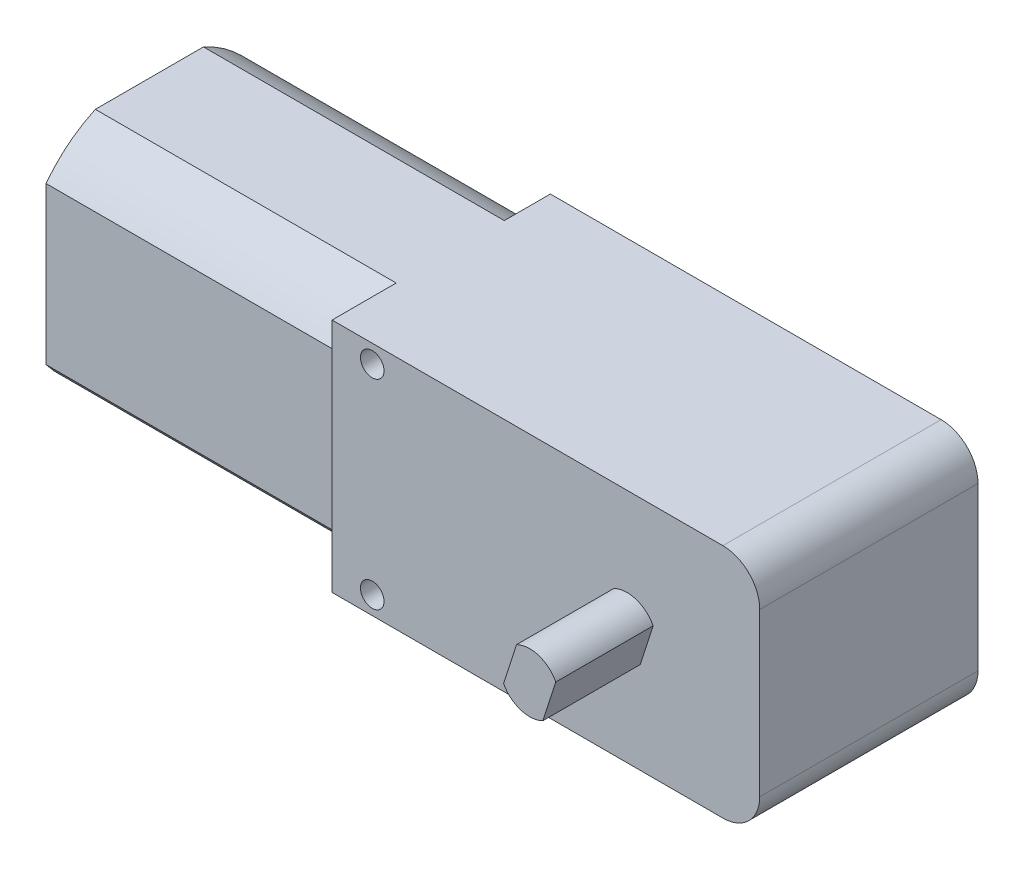
ISO-10303-21;
HEADER;
FILE_DESCRIPTION(('STEP AP214'),'2;1');
FILE_NAME('part.step','',(''),(''),'','','');
FILE_SCHEMA(('AUTOMOTIVE_DESIGN { 1 0 10303 214 1 1 1 1 }'));
ENDSEC;
DATA;
#1=APPLICATION_CONTEXT('core data for automotive mechanical design processes');
#2=APPLICATION_PROTOCOL_DEFINITION('international standard','automotive_design',2000,#1);
#3=PRODUCT_CONTEXT('',#1,'mechanical');
#4=PRODUCT('Part','Part','',(#3));
#5=PRODUCT_RELATED_PRODUCT_CATEGORY('part','',(#4));
#6=PRODUCT_DEFINITION_FORMATION('','',#4);
#7=PRODUCT_DEFINITION_CONTEXT('part definition',#1,'design');
#8=PRODUCT_DEFINITION('design','',#6,#7);
#9=PRODUCT_DEFINITION_SHAPE('','',#8);
#10=(LENGTH_UNIT() NAMED_UNIT(*) SI_UNIT(.MILLI.,.METRE.));
#11=(NAMED_UNIT(*) PLANE_ANGLE_UNIT() SI_UNIT($,.RADIAN.));
#12=(NAMED_UNIT(*) SI_UNIT($,.STERADIAN.) SOLID_ANGLE_UNIT());
#13=UNCERTAINTY_MEASURE_WITH_UNIT(LENGTH_MEASURE(1.E-05),#10,'distance_accuracy_value','');
#14=(GEOMETRIC_REPRESENTATION_CONTEXT(3) GLOBAL_UNCERTAINTY_ASSIGNED_CONTEXT((#13)) GLOBAL_UNIT_ASSIGNED_CONTEXT((#10,
#11,#12)) REPRESENTATION_CONTEXT('',''));
#15=CARTESIAN_POINT('',(0.,0.,0.));
#16=DIRECTION('',(0.,0.,1.));
#17=DIRECTION('',(1.,0.,0.));
#18=AXIS2_PLACEMENT_3D('',#15,#16,#17);
#19=CARTESIAN_POINT('',(0.,0.,18.796));
#20=DIRECTION('',(0.,0.,-1.));
#21=DIRECTION('',(-1.,0.,0.));
#22=AXIS2_PLACEMENT_3D('',#19,#20,#21);
#23=PLANE('',#22);
#24=CARTESIAN_POINT('',(3.45624911469471,8.59745796130723,18.796));
#25=DIRECTION('',(0.,0.,1.));
#26=DIRECTION('',(1.,0.,0.));
#27=AXIS2_PLACEMENT_3D('',#24,#25,#26);
#28=CIRCLE('',#27,1.016);
#29=CARTESIAN_POINT('',(4.47224911469471,8.59745796130723,18.796));
#30=VERTEX_POINT('',#29);
#31=EDGE_CURVE('E538',#30,#30,#28,.T.);
#32=ORIENTED_EDGE('',*,*,#31,.F.);
#33=EDGE_LOOP('',(#32));
#34=FACE_BOUND('',#33,.T.);
#35=CARTESIAN_POINT('',(3.45624911469471,-8.59745796130723,18.796));
#36=DIRECTION('',(0.,0.,1.));
#37=DIRECTION('',(-1.,0.,0.));
#38=AXIS2_PLACEMENT_3D('',#35,#36,#37);
#39=CIRCLE('',#38,1.016);
#40=CARTESIAN_POINT('',(2.44024911469471,-8.59745796130723,18.796));
#41=VERTEX_POINT('',#40);
#42=EDGE_CURVE('E546',#41,#41,#39,.T.);
#43=ORIENTED_EDGE('',*,*,#42,.F.);
#44=EDGE_LOOP('',(#43));
#45=FACE_BOUND('',#44,.T.);
#46=DIRECTION('',(0.,1.,0.));
#47=VECTOR('',#46,1.);
#48=CARTESIAN_POINT('',(36.83,-10.16,18.796));
#49=LINE('',#48,#47);
#50=CARTESIAN_POINT('',(36.83,-6.98499999999999,18.796));
#51=VERTEX_POINT('',#50);
#52=CARTESIAN_POINT('',(36.83,6.985,18.796));
#53=VERTEX_POINT('',#52);
#54=EDGE_CURVE('E284',#51,#53,#49,.T.);
#55=ORIENTED_EDGE('',*,*,#54,.T.);
#56=CARTESIAN_POINT('',(33.655,6.985,18.796));
#57=DIRECTION('',(0.,0.,-1.));
#58=DIRECTION('',(-1.,0.,0.));
#59=AXIS2_PLACEMENT_3D('',#56,#57,#58);
#60=CIRCLE('',#59,3.175);
#61=CARTESIAN_POINT('',(33.655,10.16,18.796));
#62=VERTEX_POINT('',#61);
#63=EDGE_CURVE('E51',#53,#62,#60,.F.);
#64=ORIENTED_EDGE('',*,*,#63,.T.);
#65=DIRECTION('',(-1.,0.,0.));
#66=VECTOR('',#65,1.);
#67=CARTESIAN_POINT('',(0.,10.16,18.796));
#68=LINE('',#67,#66);
#69=CARTESIAN_POINT('',(0.,10.16,18.796));
#70=VERTEX_POINT('',#69);
#71=EDGE_CURVE('E288',#62,#70,#68,.T.);
#72=ORIENTED_EDGE('',*,*,#71,.T.);
#73=DIRECTION('',(0.,-1.,0.));
#74=VECTOR('',#73,1.);
#75=CARTESIAN_POINT('',(0.,-10.16,18.796));
#76=LINE('',#75,#74);
#77=CARTESIAN_POINT('',(0.,-10.16,18.796));
#78=VERTEX_POINT('',#77);
#79=EDGE_CURVE('E275',#70,#78,#76,.T.);
#80=ORIENTED_EDGE('',*,*,#79,.T.);
#81=DIRECTION('',(1.,0.,0.));
#82=VECTOR('',#81,1.);
#83=CARTESIAN_POINT('',(0.,-10.16,18.796));
#84=LINE('',#83,#82);
#85=CARTESIAN_POINT('',(33.655,-10.16,18.796));
#86=VERTEX_POINT('',#85);
#87=EDGE_CURVE('E279',#78,#86,#84,.T.);
#88=ORIENTED_EDGE('',*,*,#87,.T.);
#89=CARTESIAN_POINT('',(33.655,-6.98499999999999,18.796));
#90=DIRECTION('',(0.,0.,-1.));
#91=DIRECTION('',(-1.,0.,0.));
#92=AXIS2_PLACEMENT_3D('',#89,#90,#91);
#93=CIRCLE('',#92,3.175);
#94=EDGE_CURVE('E331',#86,#51,#93,.F.);
#95=ORIENTED_EDGE('',*,*,#94,.T.);
#96=EDGE_LOOP('',(#55,#64,#72,#80,#88,#95));
#97=FACE_BOUND('',#96,.T.);
#98=CARTESIAN_POINT('',(25.4,0.,18.796));
#99=DIRECTION('',(0.,0.,1.));
#100=DIRECTION('',(1.,0.,0.));
#101=AXIS2_PLACEMENT_3D('',#98,#99,#100);
#102=CIRCLE('',#101,2.54);
#103=CARTESIAN_POINT('',(27.650324949207,1.17798031519064,18.796));
#104=VERTEX_POINT('',#103);
#105=CARTESIAN_POINT('',(24.2672618034209,2.27343444550545,18.796));
#106=VERTEX_POINT('',#105);
#107=EDGE_CURVE('E189',#104,#106,#102,.T.);
#108=ORIENTED_EDGE('',*,*,#107,.F.);
#109=DIRECTION('',(0.308057966905176,0.951367588803744,0.));
#110=VECTOR('',#109,1.);
#111=CARTESIAN_POINT('',(27.650324949207,1.17798031519064,18.796));
#112=LINE('',#111,#110);
#113=CARTESIAN_POINT('',(26.5327381965791,-2.27343444550545,18.796));
#114=VERTEX_POINT('',#113);
#115=EDGE_CURVE('E186',#114,#104,#112,.T.);
#116=ORIENTED_EDGE('',*,*,#115,.F.);
#117=CARTESIAN_POINT('',(25.4,0.,18.796));
#118=DIRECTION('',(0.,0.,1.));
#119=DIRECTION('',(1.,0.,0.));
#120=AXIS2_PLACEMENT_3D('',#117,#118,#119);
#121=CIRCLE('',#120,2.54);
#122=CARTESIAN_POINT('',(23.149675050793,-1.17798031519063,18.796));
#123=VERTEX_POINT('',#122);
#124=EDGE_CURVE('E63',#123,#114,#121,.T.);
#125=ORIENTED_EDGE('',*,*,#124,.F.);
#126=DIRECTION('',(-0.308057966905179,-0.951367588803743,0.));
#127=VECTOR('',#126,1.);
#128=CARTESIAN_POINT('',(24.2672618034209,2.27343444550545,18.796));
#129=LINE('',#128,#127);
#130=EDGE_CURVE('E58',#106,#123,#129,.T.);
#131=ORIENTED_EDGE('',*,*,#130,.F.);
#132=EDGE_LOOP('',(#108,#116,#125,#131));
#133=FACE_BOUND('',#132,.T.);
#134=ADVANCED_FACE('F42',(#34,#45,#97,#133),#23,.F.);
#135=CARTESIAN_POINT('',(0.,-10.16,18.796));
#136=DIRECTION('',(1.,0.,0.));
#137=DIRECTION('',(0.,1.,0.));
#138=AXIS2_PLACEMENT_3D('',#135,#136,#137);
#139=PLANE('',#138);
#140=CARTESIAN_POINT('',(0.,0.,8.62104587622639));
#141=DIRECTION('',(-1.,0.,0.));
#142=DIRECTION('',(0.,-1.,0.));
#143=AXIS2_PLACEMENT_3D('',#140,#141,#142);
#144=CIRCLE('',#143,11.176);
#145=CARTESIAN_POINT('',(0.,-7.112,0.));
#146=VERTEX_POINT('',#145);
#147=CARTESIAN_POINT('',(0.,-10.16,3.96514897015125));
#148=VERTEX_POINT('',#147);
#149=EDGE_CURVE('E236',#146,#148,#144,.T.);
#150=ORIENTED_EDGE('',*,*,#149,.F.);
#151=DIRECTION('',(0.,-1.,0.));
#152=VECTOR('',#151,1.);
#153=CARTESIAN_POINT('',(0.,-10.16,0.));
#154=LINE('',#153,#152);
#155=CARTESIAN_POINT('',(0.,-10.16,0.));
#156=VERTEX_POINT('',#155);
#157=EDGE_CURVE('E274',#146,#156,#154,.T.);
#158=ORIENTED_EDGE('',*,*,#157,.T.);
#159=DIRECTION('',(0.,0.,-1.));
#160=VECTOR('',#159,1.);
#161=CARTESIAN_POINT('',(0.,-10.16,18.796));
#162=LINE('',#161,#160);
#163=EDGE_CURVE('E309',#148,#156,#162,.T.);
#164=ORIENTED_EDGE('',*,*,#163,.F.);
#165=EDGE_LOOP('',(#150,#158,#164));
#166=FACE_BOUND('',#165,.T.);
#167=ADVANCED_FACE('F366',(#166),#139,.F.);
#168=CARTESIAN_POINT('',(0.,0.,8.62104587622639));
#169=DIRECTION('',(-1.,0.,0.));
#170=DIRECTION('',(0.,-1.,0.));
#171=AXIS2_PLACEMENT_3D('',#168,#169,#170);
#172=CIRCLE('',#171,11.176);
#173=CARTESIAN_POINT('',(0.,10.16,3.96514897015125));
#174=VERTEX_POINT('',#173);
#175=CARTESIAN_POINT('',(0.,7.112,0.));
#176=VERTEX_POINT('',#175);
#177=EDGE_CURVE('E232',#174,#176,#172,.T.);
#178=ORIENTED_EDGE('',*,*,#177,.F.);
#179=DIRECTION('',(0.,0.,-1.));
#180=VECTOR('',#179,1.);
#181=CARTESIAN_POINT('',(0.,10.16,18.796));
#182=LINE('',#181,#180);
#183=CARTESIAN_POINT('',(0.,10.16,0.));
#184=VERTEX_POINT('',#183);
#185=EDGE_CURVE('E291',#174,#184,#182,.T.);
#186=ORIENTED_EDGE('',*,*,#185,.T.);
#187=EDGE_CURVE('E292',#184,#176,#154,.T.);
#188=ORIENTED_EDGE('',*,*,#187,.T.);
#189=EDGE_LOOP('',(#178,#186,#188));
#190=FACE_BOUND('',#189,.T.);
#191=ADVANCED_FACE('F372',(#190),#139,.F.);
#192=CARTESIAN_POINT('',(0.,0.,8.62104587622639));
#193=DIRECTION('',(-1.,0.,0.));
#194=DIRECTION('',(0.,-1.,0.));
#195=AXIS2_PLACEMENT_3D('',#192,#193,#194);
#196=CIRCLE('',#195,11.176);
#197=CARTESIAN_POINT('',(0.,-10.16,13.2769427823015));
#198=VERTEX_POINT('',#197);
#199=CARTESIAN_POINT('',(0.,-6.75313024111688,17.526));
#200=VERTEX_POINT('',#199);
#201=EDGE_CURVE('E207',#198,#200,#196,.T.);
#202=ORIENTED_EDGE('',*,*,#201,.F.);
#203=EDGE_CURVE('E310',#78,#198,#162,.T.);
#204=ORIENTED_EDGE('',*,*,#203,.F.);
#205=ORIENTED_EDGE('',*,*,#79,.F.);
#206=CARTESIAN_POINT('',(0.,10.16,13.2769427823015));
#207=VERTEX_POINT('',#206);
#208=EDGE_CURVE('E306',#70,#207,#182,.T.);
#209=ORIENTED_EDGE('',*,*,#208,.T.);
#210=CARTESIAN_POINT('',(0.,0.,8.62104587622639));
#211=DIRECTION('',(-1.,0.,0.));
#212=DIRECTION('',(0.,-1.,0.));
#213=AXIS2_PLACEMENT_3D('',#210,#211,#212);
#214=CIRCLE('',#213,11.176);
#215=CARTESIAN_POINT('',(0.,6.75313024111688,17.526));
#216=VERTEX_POINT('',#215);
#217=EDGE_CURVE('E196',#216,#207,#214,.T.);
#218=ORIENTED_EDGE('',*,*,#217,.F.);
#219=DIRECTION('',(0.,1.,0.));
#220=VECTOR('',#219,1.);
#221=CARTESIAN_POINT('',(0.,0.,17.526));
#222=LINE('',#221,#220);
#223=EDGE_CURVE('E191',#200,#216,#222,.T.);
#224=ORIENTED_EDGE('',*,*,#223,.F.);
#225=EDGE_LOOP('',(#202,#204,#205,#209,#218,#224));
#226=FACE_BOUND('',#225,.T.);
#227=ADVANCED_FACE('F388',(#226),#139,.F.);
#228=CARTESIAN_POINT('',(0.,-10.16,18.796));
#229=DIRECTION('',(0.,1.,0.));
#230=DIRECTION('',(-1.,0.,0.));
#231=AXIS2_PLACEMENT_3D('',#228,#229,#230);
#232=PLANE('',#231);
#233=DIRECTION('',(1.,0.,0.));
#234=VECTOR('',#233,1.);
#235=CARTESIAN_POINT('',(0.,-10.16,0.));
#236=LINE('',#235,#234);
#237=CARTESIAN_POINT('',(33.655,-10.16,0.));
#238=VERTEX_POINT('',#237);
#239=EDGE_CURVE('E295',#156,#238,#236,.T.);
#240=ORIENTED_EDGE('',*,*,#239,.T.);
#241=DIRECTION('',(0.,0.,-1.));
#242=VECTOR('',#241,1.);
#243=CARTESIAN_POINT('',(33.655,-10.16,18.796));
#244=LINE('',#243,#242);
#245=EDGE_CURVE('E11',#238,#86,#244,.F.);
#246=ORIENTED_EDGE('',*,*,#245,.T.);
#247=ORIENTED_EDGE('',*,*,#87,.F.);
#248=ORIENTED_EDGE('',*,*,#203,.T.);
#249=DIRECTION('',(1.,0.,0.));
#250=VECTOR('',#249,1.);
#251=CARTESIAN_POINT('',(-25.908,-10.16,13.2769427823015));
#252=LINE('',#251,#250);
#253=CARTESIAN_POINT('',(-25.908,-10.16,13.2769427823015));
#254=VERTEX_POINT('',#253);
#255=EDGE_CURVE('E246',#254,#198,#252,.T.);
#256=ORIENTED_EDGE('',*,*,#255,.F.);
#257=DIRECTION('',(0.,0.,1.));
#258=VECTOR('',#257,1.);
#259=CARTESIAN_POINT('',(-25.908,-10.16,0.));
#260=LINE('',#259,#258);
#261=CARTESIAN_POINT('',(-25.908,-10.16,3.96514897015125));
#262=VERTEX_POINT('',#261);
#263=EDGE_CURVE('E222',#262,#254,#260,.T.);
#264=ORIENTED_EDGE('',*,*,#263,.F.);
#265=DIRECTION('',(1.,0.,0.));
#266=VECTOR('',#265,1.);
#267=CARTESIAN_POINT('',(-25.908,-10.16,3.96514897015125));
#268=LINE('',#267,#266);
#269=EDGE_CURVE('E250',#262,#148,#268,.T.);
#270=ORIENTED_EDGE('',*,*,#269,.T.);
#271=ORIENTED_EDGE('',*,*,#163,.T.);
#272=EDGE_LOOP('',(#240,#246,#247,#248,#256,#264,#270,#271));
#273=FACE_BOUND('',#272,.T.);
#274=ADVANCED_FACE('F360',(#273),#232,.F.);
#275=CARTESIAN_POINT('',(36.83,-10.16,18.796));
#276=DIRECTION('',(-1.,0.,0.));
#277=DIRECTION('',(0.,-1.,0.));
#278=AXIS2_PLACEMENT_3D('',#275,#276,#277);
#279=PLANE('',#278);
#280=DIRECTION('',(0.,1.,0.));
#281=VECTOR('',#280,1.);
#282=CARTESIAN_POINT('',(36.83,-10.16,0.));
#283=LINE('',#282,#281);
#284=CARTESIAN_POINT('',(36.83,-6.98499999999999,0.));
#285=VERTEX_POINT('',#284);
#286=CARTESIAN_POINT('',(36.83,6.985,0.));
#287=VERTEX_POINT('',#286);
#288=EDGE_CURVE('E299',#285,#287,#283,.T.);
#289=ORIENTED_EDGE('',*,*,#288,.T.);
#290=DIRECTION('',(0.,0.,-1.));
#291=VECTOR('',#290,1.);
#292=CARTESIAN_POINT('',(36.83,6.985,18.796));
#293=LINE('',#292,#291);
#294=EDGE_CURVE('E328',#287,#53,#293,.F.);
#295=ORIENTED_EDGE('',*,*,#294,.T.);
#296=ORIENTED_EDGE('',*,*,#54,.F.);
#297=DIRECTION('',(0.,0.,-1.));
#298=VECTOR('',#297,1.);
#299=CARTESIAN_POINT('',(36.83,-6.98499999999999,18.796));
#300=LINE('',#299,#298);
#301=EDGE_CURVE('E324',#51,#285,#300,.T.);
#302=ORIENTED_EDGE('',*,*,#301,.T.);
#303=EDGE_LOOP('',(#289,#295,#296,#302));
#304=FACE_BOUND('',#303,.T.);
#305=ADVANCED_FACE('F352',(#304),#279,.F.);
#306=CARTESIAN_POINT('',(0.,10.16,18.796));
#307=DIRECTION('',(0.,-1.,0.));
#308=DIRECTION('',(0.,0.,-1.));
#309=AXIS2_PLACEMENT_3D('',#306,#307,#308);
#310=PLANE('',#309);
#311=ORIENTED_EDGE('',*,*,#71,.F.);
#312=DIRECTION('',(0.,0.,-1.));
#313=VECTOR('',#312,1.);
#314=CARTESIAN_POINT('',(33.655,10.16,18.796));
#315=LINE('',#314,#313);
#316=CARTESIAN_POINT('',(33.655,10.16,0.));
#317=VERTEX_POINT('',#316);
#318=EDGE_CURVE('E314',#62,#317,#315,.T.);
#319=ORIENTED_EDGE('',*,*,#318,.T.);
#320=DIRECTION('',(-1.,0.,0.));
#321=VECTOR('',#320,1.);
#322=CARTESIAN_POINT('',(0.,10.16,0.));
#323=LINE('',#322,#321);
#324=EDGE_CURVE('E280',#317,#184,#323,.T.);
#325=ORIENTED_EDGE('',*,*,#324,.T.);
#326=ORIENTED_EDGE('',*,*,#185,.F.);
#327=DIRECTION('',(1.,0.,0.));
#328=VECTOR('',#327,1.);
#329=CARTESIAN_POINT('',(-25.908,10.16,3.96514897015125));
#330=LINE('',#329,#328);
#331=CARTESIAN_POINT('',(-25.908,10.16,3.96514897015125));
#332=VERTEX_POINT('',#331);
#333=EDGE_CURVE('E262',#332,#174,#330,.T.);
#334=ORIENTED_EDGE('',*,*,#333,.F.);
#335=DIRECTION('',(0.,0.,-1.));
#336=VECTOR('',#335,1.);
#337=CARTESIAN_POINT('',(-25.908,10.16,0.));
#338=LINE('',#337,#336);
#339=CARTESIAN_POINT('',(-25.908,10.16,13.2769427823015));
#340=VERTEX_POINT('',#339);
#341=EDGE_CURVE('E210',#340,#332,#338,.T.);
#342=ORIENTED_EDGE('',*,*,#341,.F.);
#343=DIRECTION('',(1.,0.,0.));
#344=VECTOR('',#343,1.);
#345=CARTESIAN_POINT('',(-25.908,10.16,13.2769427823015));
#346=LINE('',#345,#344);
#347=EDGE_CURVE('E266',#340,#207,#346,.T.);
#348=ORIENTED_EDGE('',*,*,#347,.T.);
#349=ORIENTED_EDGE('',*,*,#208,.F.);
#350=EDGE_LOOP('',(#311,#319,#325,#326,#334,#342,#348,#349));
#351=FACE_BOUND('',#350,.T.);
#352=ADVANCED_FACE('F343',(#351),#310,.F.);
#353=CARTESIAN_POINT('',(0.,0.,0.));
#354=DIRECTION('',(0.,0.,-1.));
#355=DIRECTION('',(-1.,0.,0.));
#356=AXIS2_PLACEMENT_3D('',#353,#354,#355);
#357=PLANE('',#356);
#358=CARTESIAN_POINT('',(3.45624911469471,8.59745796130723,0.));
#359=DIRECTION('',(0.,0.,1.));
#360=DIRECTION('',(1.,0.,0.));
#361=AXIS2_PLACEMENT_3D('',#358,#359,#360);
#362=CIRCLE('',#361,1.016);
#363=CARTESIAN_POINT('',(4.47224911469471,8.59745796130723,0.));
#364=VERTEX_POINT('',#363);
#365=EDGE_CURVE('E536',#364,#364,#362,.T.);
#366=ORIENTED_EDGE('',*,*,#365,.T.);
#367=EDGE_LOOP('',(#366));
#368=FACE_BOUND('',#367,.T.);
#369=CARTESIAN_POINT('',(3.45624911469471,-8.59745796130723,0.));
#370=DIRECTION('',(0.,0.,1.));
#371=DIRECTION('',(-1.,0.,0.));
#372=AXIS2_PLACEMENT_3D('',#369,#370,#371);
#373=CIRCLE('',#372,1.016);
#374=CARTESIAN_POINT('',(2.44024911469471,-8.59745796130723,0.));
#375=VERTEX_POINT('',#374);
#376=EDGE_CURVE('E540',#375,#375,#373,.T.);
#377=ORIENTED_EDGE('',*,*,#376,.T.);
#378=EDGE_LOOP('',(#377));
#379=FACE_BOUND('',#378,.T.);
#380=ORIENTED_EDGE('',*,*,#324,.F.);
#381=CARTESIAN_POINT('',(33.655,6.985,0.));
#382=DIRECTION('',(0.,0.,-1.));
#383=DIRECTION('',(-1.,0.,0.));
#384=AXIS2_PLACEMENT_3D('',#381,#382,#383);
#385=CIRCLE('',#384,3.175);
#386=EDGE_CURVE('E321',#317,#287,#385,.T.);
#387=ORIENTED_EDGE('',*,*,#386,.T.);
#388=ORIENTED_EDGE('',*,*,#288,.F.);
#389=CARTESIAN_POINT('',(33.655,-6.98499999999999,0.));
#390=DIRECTION('',(0.,0.,-1.));
#391=DIRECTION('',(-1.,0.,0.));
#392=AXIS2_PLACEMENT_3D('',#389,#390,#391);
#393=CIRCLE('',#392,3.175);
#394=EDGE_CURVE('E318',#285,#238,#393,.T.);
#395=ORIENTED_EDGE('',*,*,#394,.T.);
#396=ORIENTED_EDGE('',*,*,#239,.F.);
#397=ORIENTED_EDGE('',*,*,#157,.F.);
#398=DIRECTION('',(1.,0.,0.));
#399=VECTOR('',#398,1.);
#400=CARTESIAN_POINT('',(-25.908,-7.112,0.));
#401=LINE('',#400,#399);
#402=CARTESIAN_POINT('',(-25.908,-7.112,0.));
#403=VERTEX_POINT('',#402);
#404=EDGE_CURVE('E254',#403,#146,#401,.T.);
#405=ORIENTED_EDGE('',*,*,#404,.F.);
#406=DIRECTION('',(0.,-1.,0.));
#407=VECTOR('',#406,1.);
#408=CARTESIAN_POINT('',(-25.908,0.,0.));
#409=LINE('',#408,#407);
#410=CARTESIAN_POINT('',(-25.908,7.112,0.));
#411=VERTEX_POINT('',#410);
#412=EDGE_CURVE('E216',#411,#403,#409,.T.);
#413=ORIENTED_EDGE('',*,*,#412,.F.);
#414=DIRECTION('',(1.,0.,0.));
#415=VECTOR('',#414,1.);
#416=CARTESIAN_POINT('',(-25.908,7.112,0.));
#417=LINE('',#416,#415);
#418=EDGE_CURVE('E258',#411,#176,#417,.T.);
#419=ORIENTED_EDGE('',*,*,#418,.T.);
#420=ORIENTED_EDGE('',*,*,#187,.F.);
#421=EDGE_LOOP('',(#380,#387,#388,#395,#396,#397,#405,#413,#419,#420));
#422=FACE_BOUND('',#421,.T.);
#423=ADVANCED_FACE('F349',(#368,#379,#422),#357,.T.);
#424=CARTESIAN_POINT('',(33.655,6.985,18.796));
#425=DIRECTION('',(0.,0.,-1.));
#426=DIRECTION('',(-1.,0.,0.));
#427=AXIS2_PLACEMENT_3D('',#424,#425,#426);
#428=CYLINDRICAL_SURFACE('',#427,3.175);
#429=ORIENTED_EDGE('',*,*,#63,.F.);
#430=ORIENTED_EDGE('',*,*,#294,.F.);
#431=ORIENTED_EDGE('',*,*,#386,.F.);
#432=ORIENTED_EDGE('',*,*,#318,.F.);
#433=EDGE_LOOP('',(#429,#430,#431,#432));
#434=FACE_BOUND('',#433,.T.);
#435=ADVANCED_FACE('F346',(#434),#428,.T.);
#436=CARTESIAN_POINT('',(33.655,-6.98499999999999,18.796));
#437=DIRECTION('',(0.,0.,-1.));
#438=DIRECTION('',(-1.,0.,0.));
#439=AXIS2_PLACEMENT_3D('',#436,#437,#438);
#440=CYLINDRICAL_SURFACE('',#439,3.175);
#441=ORIENTED_EDGE('',*,*,#94,.F.);
#442=ORIENTED_EDGE('',*,*,#245,.F.);
#443=ORIENTED_EDGE('',*,*,#394,.F.);
#444=ORIENTED_EDGE('',*,*,#301,.F.);
#445=EDGE_LOOP('',(#441,#442,#443,#444));
#446=FACE_BOUND('',#445,.T.);
#447=ADVANCED_FACE('F44',(#446),#440,.T.);
#448=CARTESIAN_POINT('',(-25.908,0.,17.526));
#449=DIRECTION('',(0.,0.,-1.));
#450=DIRECTION('',(-1.,0.,0.));
#451=AXIS2_PLACEMENT_3D('',#448,#449,#450);
#452=PLANE('',#451);
#453=ORIENTED_EDGE('',*,*,#223,.T.);
#454=DIRECTION('',(1.,0.,0.));
#455=VECTOR('',#454,1.);
#456=CARTESIAN_POINT('',(-25.908,6.75313024111688,17.526));
#457=LINE('',#456,#455);
#458=CARTESIAN_POINT('',(-25.908,6.75313024111688,17.526));
#459=VERTEX_POINT('',#458);
#460=EDGE_CURVE('E270',#459,#216,#457,.T.);
#461=ORIENTED_EDGE('',*,*,#460,.F.);
#462=DIRECTION('',(0.,1.,0.));
#463=VECTOR('',#462,1.);
#464=CARTESIAN_POINT('',(-25.908,0.,17.526));
#465=LINE('',#464,#463);
#466=CARTESIAN_POINT('',(-25.908,-6.75313024111689,17.526));
#467=VERTEX_POINT('',#466);
#468=EDGE_CURVE('E202',#467,#459,#465,.T.);
#469=ORIENTED_EDGE('',*,*,#468,.F.);
#470=DIRECTION('',(1.,0.,0.));
#471=VECTOR('',#470,1.);
#472=CARTESIAN_POINT('',(-25.908,-6.75313024111689,17.526));
#473=LINE('',#472,#471);
#474=EDGE_CURVE('E227',#467,#200,#473,.T.);
#475=ORIENTED_EDGE('',*,*,#474,.T.);
#476=EDGE_LOOP('',(#453,#461,#469,#475));
#477=FACE_BOUND('',#476,.T.);
#478=ADVANCED_FACE('F419',(#477),#452,.F.);
#479=CARTESIAN_POINT('',(-25.908,0.,8.62104587622639));
#480=DIRECTION('',(1.,0.,0.));
#481=DIRECTION('',(0.,1.,0.));
#482=AXIS2_PLACEMENT_3D('',#479,#480,#481);
#483=CYLINDRICAL_SURFACE('',#482,11.176);
#484=ORIENTED_EDGE('',*,*,#217,.T.);
#485=ORIENTED_EDGE('',*,*,#347,.F.);
#486=CARTESIAN_POINT('',(-25.908,0.,8.62104587622639));
#487=DIRECTION('',(-1.,0.,0.));
#488=DIRECTION('',(0.,-1.,0.));
#489=AXIS2_PLACEMENT_3D('',#486,#487,#488);
#490=CIRCLE('',#489,11.176);
#491=EDGE_CURVE('E206',#459,#340,#490,.T.);
#492=ORIENTED_EDGE('',*,*,#491,.F.);
#493=ORIENTED_EDGE('',*,*,#460,.T.);
#494=EDGE_LOOP('',(#484,#485,#492,#493));
#495=FACE_BOUND('',#494,.T.);
#496=ADVANCED_FACE('F386',(#495),#483,.T.);
#497=CARTESIAN_POINT('',(-25.908,0.,8.62104587622639));
#498=DIRECTION('',(1.,0.,0.));
#499=DIRECTION('',(0.,1.,0.));
#500=AXIS2_PLACEMENT_3D('',#497,#498,#499);
#501=CYLINDRICAL_SURFACE('',#500,11.176);
#502=ORIENTED_EDGE('',*,*,#177,.T.);
#503=ORIENTED_EDGE('',*,*,#418,.F.);
#504=CARTESIAN_POINT('',(-25.908,0.,8.62104587622639));
#505=DIRECTION('',(-1.,0.,0.));
#506=DIRECTION('',(0.,-1.,0.));
#507=AXIS2_PLACEMENT_3D('',#504,#505,#506);
#508=CIRCLE('',#507,11.176);
#509=EDGE_CURVE('E213',#332,#411,#508,.T.);
#510=ORIENTED_EDGE('',*,*,#509,.F.);
#511=ORIENTED_EDGE('',*,*,#333,.T.);
#512=EDGE_LOOP('',(#502,#503,#510,#511));
#513=FACE_BOUND('',#512,.T.);
#514=ADVANCED_FACE('F378',(#513),#501,.T.);
#515=CARTESIAN_POINT('',(-25.908,0.,8.62104587622639));
#516=DIRECTION('',(1.,0.,0.));
#517=DIRECTION('',(0.,1.,0.));
#518=AXIS2_PLACEMENT_3D('',#515,#516,#517);
#519=CYLINDRICAL_SURFACE('',#518,11.176);
#520=ORIENTED_EDGE('',*,*,#149,.T.);
#521=ORIENTED_EDGE('',*,*,#269,.F.);
#522=CARTESIAN_POINT('',(-25.908,0.,8.62104587622639));
#523=DIRECTION('',(-1.,0.,0.));
#524=DIRECTION('',(0.,-1.,0.));
#525=AXIS2_PLACEMENT_3D('',#522,#523,#524);
#526=CIRCLE('',#525,11.176);
#527=EDGE_CURVE('E219',#403,#262,#526,.T.);
#528=ORIENTED_EDGE('',*,*,#527,.F.);
#529=ORIENTED_EDGE('',*,*,#404,.T.);
#530=EDGE_LOOP('',(#520,#521,#528,#529));
#531=FACE_BOUND('',#530,.T.);
#532=ADVANCED_FACE('F397',(#531),#519,.T.);
#533=CARTESIAN_POINT('',(-25.908,0.,8.62104587622639));
#534=DIRECTION('',(1.,0.,0.));
#535=DIRECTION('',(0.,1.,0.));
#536=AXIS2_PLACEMENT_3D('',#533,#534,#535);
#537=CYLINDRICAL_SURFACE('',#536,11.176);
#538=ORIENTED_EDGE('',*,*,#201,.T.);
#539=ORIENTED_EDGE('',*,*,#474,.F.);
#540=CARTESIAN_POINT('',(-25.908,0.,8.62104587622639));
#541=DIRECTION('',(-1.,0.,0.));
#542=DIRECTION('',(0.,-1.,0.));
#543=AXIS2_PLACEMENT_3D('',#540,#541,#542);
#544=CIRCLE('',#543,11.176);
#545=EDGE_CURVE('E225',#254,#467,#544,.T.);
#546=ORIENTED_EDGE('',*,*,#545,.F.);
#547=ORIENTED_EDGE('',*,*,#255,.T.);
#548=EDGE_LOOP('',(#538,#539,#546,#547));
#549=FACE_BOUND('',#548,.T.);
#550=ADVANCED_FACE('F393',(#549),#537,.T.);
#551=CARTESIAN_POINT('',(-25.908,0.,0.));
#552=DIRECTION('',(-1.,0.,0.));
#553=DIRECTION('',(0.,-1.,0.));
#554=AXIS2_PLACEMENT_3D('',#551,#552,#553);
#555=PLANE('',#554);
#556=ORIENTED_EDGE('',*,*,#468,.T.);
#557=ORIENTED_EDGE('',*,*,#491,.T.);
#558=ORIENTED_EDGE('',*,*,#341,.T.);
#559=ORIENTED_EDGE('',*,*,#509,.T.);
#560=ORIENTED_EDGE('',*,*,#412,.T.);
#561=ORIENTED_EDGE('',*,*,#527,.T.);
#562=ORIENTED_EDGE('',*,*,#263,.T.);
#563=ORIENTED_EDGE('',*,*,#545,.T.);
#564=EDGE_LOOP('',(#556,#557,#558,#559,#560,#561,#562,#563));
#565=FACE_BOUND('',#564,.T.);
#566=ADVANCED_FACE('F382',(#565),#555,.T.);
#567=CARTESIAN_POINT('',(25.4,0.,27.178));
#568=DIRECTION('',(0.,0.,-1.));
#569=DIRECTION('',(-1.,0.,0.));
#570=AXIS2_PLACEMENT_3D('',#567,#568,#569);
#571=CYLINDRICAL_SURFACE('',#570,2.54);
#572=ORIENTED_EDGE('',*,*,#107,.T.);
#573=DIRECTION('',(0.,0.,-1.));
#574=VECTOR('',#573,1.);
#575=CARTESIAN_POINT('',(24.2672618034209,2.27343444550545,27.178));
#576=LINE('',#575,#574);
#577=CARTESIAN_POINT('',(24.2672618034209,2.27343444550545,27.178));
#578=VERTEX_POINT('',#577);
#579=EDGE_CURVE('E168',#578,#106,#576,.T.);
#580=ORIENTED_EDGE('',*,*,#579,.F.);
#581=CARTESIAN_POINT('',(25.4,0.,27.178));
#582=DIRECTION('',(0.,0.,1.));
#583=DIRECTION('',(1.,0.,0.));
#584=AXIS2_PLACEMENT_3D('',#581,#582,#583);
#585=CIRCLE('',#584,2.54);
#586=CARTESIAN_POINT('',(27.650324949207,1.17798031519064,27.178));
#587=VERTEX_POINT('',#586);
#588=EDGE_CURVE('E176',#587,#578,#585,.T.);
#589=ORIENTED_EDGE('',*,*,#588,.F.);
#590=DIRECTION('',(0.,0.,-1.));
#591=VECTOR('',#590,1.);
#592=CARTESIAN_POINT('',(27.650324949207,1.17798031519064,27.178));
#593=LINE('',#592,#591);
#594=EDGE_CURVE('E556',#587,#104,#593,.T.);
#595=ORIENTED_EDGE('',*,*,#594,.T.);
#596=EDGE_LOOP('',(#572,#580,#589,#595));
#597=FACE_BOUND('',#596,.T.);
#598=ADVANCED_FACE('F188',(#597),#571,.T.);
#599=CARTESIAN_POINT('',(24.2672618034209,2.27343444550545,27.178));
#600=DIRECTION('',(0.951367588803743,-0.308057966905179,0.));
#601=DIRECTION('',(0.308057966905179,0.951367588803743,0.));
#602=AXIS2_PLACEMENT_3D('',#599,#600,#601);
#603=PLANE('',#602);
#604=ORIENTED_EDGE('',*,*,#130,.T.);
#605=DIRECTION('',(0.,0.,-1.));
#606=VECTOR('',#605,1.);
#607=CARTESIAN_POINT('',(23.149675050793,-1.17798031519063,27.178));
#608=LINE('',#607,#606);
#609=CARTESIAN_POINT('',(23.149675050793,-1.17798031519063,27.178));
#610=VERTEX_POINT('',#609);
#611=EDGE_CURVE('E171',#610,#123,#608,.T.);
#612=ORIENTED_EDGE('',*,*,#611,.F.);
#613=DIRECTION('',(-0.308057966905179,-0.951367588803743,0.));
#614=VECTOR('',#613,1.);
#615=CARTESIAN_POINT('',(24.2672618034209,2.27343444550545,27.178));
#616=LINE('',#615,#614);
#617=EDGE_CURVE('E164',#578,#610,#616,.T.);
#618=ORIENTED_EDGE('',*,*,#617,.F.);
#619=ORIENTED_EDGE('',*,*,#579,.T.);
#620=EDGE_LOOP('',(#604,#612,#618,#619));
#621=FACE_BOUND('',#620,.T.);
#622=ADVANCED_FACE('F166',(#621),#603,.F.);
#623=CARTESIAN_POINT('',(25.4,0.,27.178));
#624=DIRECTION('',(0.,0.,-1.));
#625=DIRECTION('',(-1.,0.,0.));
#626=AXIS2_PLACEMENT_3D('',#623,#624,#625);
#627=CYLINDRICAL_SURFACE('',#626,2.54);
#628=ORIENTED_EDGE('',*,*,#124,.T.);
#629=DIRECTION('',(0.,0.,-1.));
#630=VECTOR('',#629,1.);
#631=CARTESIAN_POINT('',(26.5327381965791,-2.27343444550545,27.178));
#632=LINE('',#631,#630);
#633=CARTESIAN_POINT('',(26.5327381965791,-2.27343444550545,27.178));
#634=VERTEX_POINT('',#633);
#635=EDGE_CURVE('E198',#634,#114,#632,.T.);
#636=ORIENTED_EDGE('',*,*,#635,.F.);
#637=CARTESIAN_POINT('',(25.4,0.,27.178));
#638=DIRECTION('',(0.,0.,1.));
#639=DIRECTION('',(1.,0.,0.));
#640=AXIS2_PLACEMENT_3D('',#637,#638,#639);
#641=CIRCLE('',#640,2.54);
#642=EDGE_CURVE('E175',#610,#634,#641,.T.);
#643=ORIENTED_EDGE('',*,*,#642,.F.);
#644=ORIENTED_EDGE('',*,*,#611,.T.);
#645=EDGE_LOOP('',(#628,#636,#643,#644));
#646=FACE_BOUND('',#645,.T.);
#647=ADVANCED_FACE('F483',(#646),#627,.T.);
#648=CARTESIAN_POINT('',(27.650324949207,1.17798031519064,27.178));
#649=DIRECTION('',(-0.951367588803744,0.308057966905176,0.));
#650=DIRECTION('',(-0.308057966905176,-0.951367588803744,0.));
#651=AXIS2_PLACEMENT_3D('',#648,#649,#650);
#652=PLANE('',#651);
#653=ORIENTED_EDGE('',*,*,#115,.T.);
#654=ORIENTED_EDGE('',*,*,#594,.F.);
#655=DIRECTION('',(0.308057966905176,0.951367588803744,0.));
#656=VECTOR('',#655,1.);
#657=CARTESIAN_POINT('',(27.650324949207,1.17798031519064,27.178));
#658=LINE('',#657,#656);
#659=EDGE_CURVE('E181',#634,#587,#658,.T.);
#660=ORIENTED_EDGE('',*,*,#659,.F.);
#661=ORIENTED_EDGE('',*,*,#635,.T.);
#662=EDGE_LOOP('',(#653,#654,#660,#661));
#663=FACE_BOUND('',#662,.T.);
#664=ADVANCED_FACE('F492',(#663),#652,.F.);
#665=CARTESIAN_POINT('',(25.4,0.,27.178));
#666=DIRECTION('',(0.,0.,1.));
#667=DIRECTION('',(1.,0.,0.));
#668=AXIS2_PLACEMENT_3D('',#665,#666,#667);
#669=PLANE('',#668);
#670=ORIENTED_EDGE('',*,*,#588,.T.);
#671=ORIENTED_EDGE('',*,*,#617,.T.);
#672=ORIENTED_EDGE('',*,*,#642,.T.);
#673=ORIENTED_EDGE('',*,*,#659,.T.);
#674=EDGE_LOOP('',(#670,#671,#672,#673));
#675=FACE_BOUND('',#674,.T.);
#676=ADVANCED_FACE('F179',(#675),#669,.T.);
#677=CARTESIAN_POINT('',(3.45624911469471,-8.59745796130723,0.));
#678=DIRECTION('',(0.,0.,1.));
#679=DIRECTION('',(1.,0.,0.));
#680=AXIS2_PLACEMENT_3D('',#677,#678,#679);
#681=CYLINDRICAL_SURFACE('',#680,1.016);
#682=ORIENTED_EDGE('',*,*,#376,.F.);
#683=EDGE_LOOP('',(#682));
#684=FACE_BOUND('',#683,.T.);
#685=ORIENTED_EDGE('',*,*,#42,.T.);
#686=EDGE_LOOP('',(#685));
#687=FACE_BOUND('',#686,.T.);
#688=ADVANCED_FACE('F509',(#684,#687),#681,.F.);
#689=CARTESIAN_POINT('',(3.45624911469471,8.59745796130723,0.));
#690=DIRECTION('',(0.,0.,1.));
#691=DIRECTION('',(1.,0.,0.));
#692=AXIS2_PLACEMENT_3D('',#689,#690,#691);
#693=CYLINDRICAL_SURFACE('',#692,1.016);
#694=ORIENTED_EDGE('',*,*,#365,.F.);
#695=EDGE_LOOP('',(#694));
#696=FACE_BOUND('',#695,.T.);
#697=ORIENTED_EDGE('',*,*,#31,.T.);
#698=EDGE_LOOP('',(#697));
#699=FACE_BOUND('',#698,.T.);
#700=ADVANCED_FACE('F519',(#696,#699),#693,.F.);
#701=CLOSED_SHELL('',(#134,#167,#191,#227,#274,#305,#352,#423,#435,#447,#478,#496,#514,#532,
#550,#566,#598,#622,#647,#664,#676,#688,#700));
#702=MANIFOLD_SOLID_BREP('B2',#701);
#703=ADVANCED_BREP_SHAPE_REPRESENTATION('',(#18,#702),#14);
#704=SHAPE_DEFINITION_REPRESENTATION(#9,#703);
ENDSEC;
END-ISO-10303-21;
